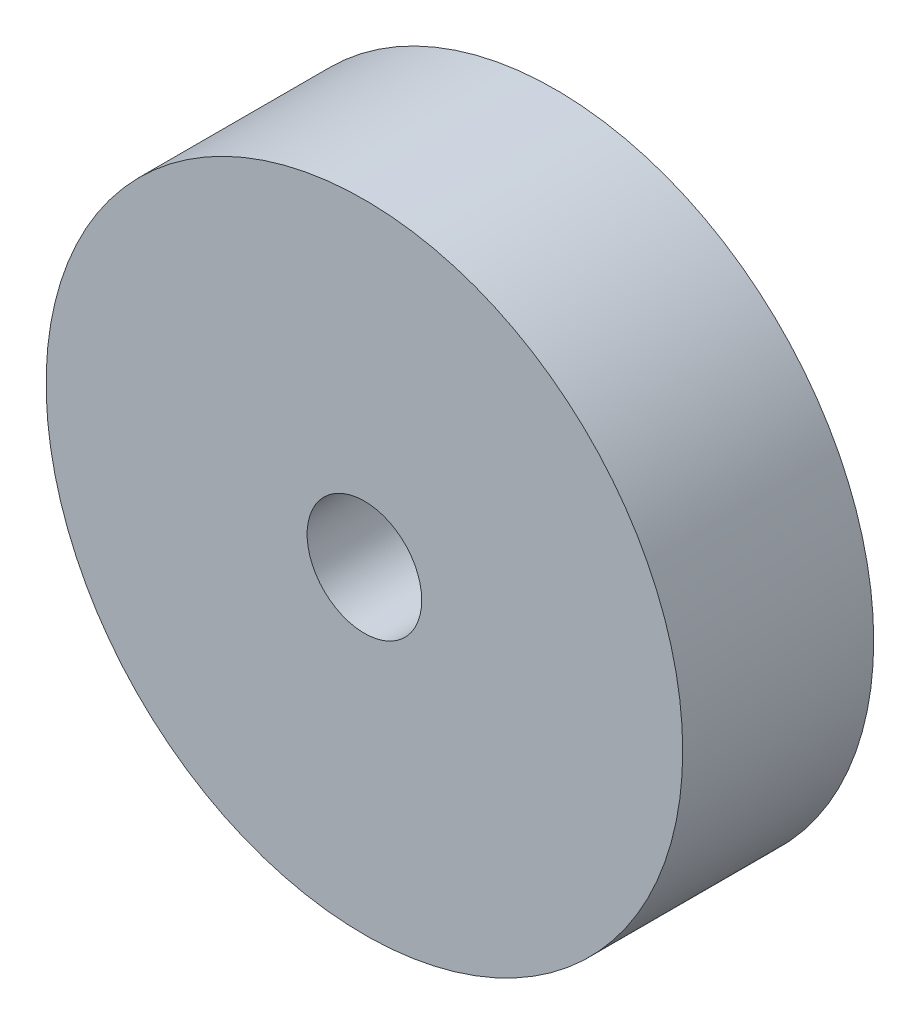
ISO-10303-21;
HEADER;
FILE_DESCRIPTION(('STEP AP214'),'2;1');
FILE_NAME('part.step','',(''),(''),'','','');
FILE_SCHEMA(('AUTOMOTIVE_DESIGN { 1 0 10303 214 1 1 1 1 }'));
ENDSEC;
DATA;
#1=APPLICATION_CONTEXT('core data for automotive mechanical design processes');
#2=APPLICATION_PROTOCOL_DEFINITION('international standard','automotive_design',2000,#1);
#3=PRODUCT_CONTEXT('',#1,'mechanical');
#4=PRODUCT('Part','Part','',(#3));
#5=PRODUCT_RELATED_PRODUCT_CATEGORY('part','',(#4));
#6=PRODUCT_DEFINITION_FORMATION('','',#4);
#7=PRODUCT_DEFINITION_CONTEXT('part definition',#1,'design');
#8=PRODUCT_DEFINITION('design','',#6,#7);
#9=PRODUCT_DEFINITION_SHAPE('','',#8);
#10=(LENGTH_UNIT() NAMED_UNIT(*) SI_UNIT(.MILLI.,.METRE.));
#11=(NAMED_UNIT(*) PLANE_ANGLE_UNIT() SI_UNIT($,.RADIAN.));
#12=(NAMED_UNIT(*) SI_UNIT($,.STERADIAN.) SOLID_ANGLE_UNIT());
#13=UNCERTAINTY_MEASURE_WITH_UNIT(LENGTH_MEASURE(1.E-05),#10,'distance_accuracy_value','');
#14=(GEOMETRIC_REPRESENTATION_CONTEXT(3) GLOBAL_UNCERTAINTY_ASSIGNED_CONTEXT((#13)) GLOBAL_UNIT_ASSIGNED_CONTEXT((#10,
#11,#12)) REPRESENTATION_CONTEXT('',''));
#15=CARTESIAN_POINT('',(0.,0.,0.));
#16=DIRECTION('',(0.,0.,1.));
#17=DIRECTION('',(1.,0.,0.));
#18=AXIS2_PLACEMENT_3D('',#15,#16,#17);
#19=CARTESIAN_POINT('',(0.,0.,3.));
#20=DIRECTION('',(0.,0.,1.));
#21=DIRECTION('',(1.,0.,0.));
#22=AXIS2_PLACEMENT_3D('',#19,#20,#21);
#23=PLANE('',#22);
#24=CARTESIAN_POINT('',(0.,0.,3.));
#25=DIRECTION('',(0.,0.,1.));
#26=DIRECTION('',(1.,0.,0.));
#27=AXIS2_PLACEMENT_3D('',#24,#25,#26);
#28=CIRCLE('',#27,5.);
#29=CARTESIAN_POINT('',(5.,0.,3.));
#30=VERTEX_POINT('',#29);
#31=EDGE_CURVE('E10',#30,#30,#28,.T.);
#32=ORIENTED_EDGE('',*,*,#31,.T.);
#33=EDGE_LOOP('',(#32));
#34=FACE_BOUND('',#33,.T.);
#35=CARTESIAN_POINT('',(0.,0.,3.));
#36=DIRECTION('',(0.,0.,1.));
#37=DIRECTION('',(1.,0.,0.));
#38=AXIS2_PLACEMENT_3D('',#35,#36,#37);
#39=CIRCLE('',#38,0.9);
#40=CARTESIAN_POINT('',(0.9,0.,3.));
#41=VERTEX_POINT('',#40);
#42=EDGE_CURVE('E54',#41,#41,#39,.T.);
#43=ORIENTED_EDGE('',*,*,#42,.F.);
#44=EDGE_LOOP('',(#43));
#45=FACE_BOUND('',#44,.T.);
#46=ADVANCED_FACE('F41',(#34,#45),#23,.T.);
#47=CARTESIAN_POINT('',(0.,0.,0.));
#48=DIRECTION('',(0.,0.,1.));
#49=DIRECTION('',(1.,0.,0.));
#50=AXIS2_PLACEMENT_3D('',#47,#48,#49);
#51=PLANE('',#50);
#52=CARTESIAN_POINT('',(0.,0.,0.));
#53=DIRECTION('',(0.,0.,1.));
#54=DIRECTION('',(1.,0.,0.));
#55=AXIS2_PLACEMENT_3D('',#52,#53,#54);
#56=CIRCLE('',#55,5.);
#57=CARTESIAN_POINT('',(5.,0.,0.));
#58=VERTEX_POINT('',#57);
#59=EDGE_CURVE('E45',#58,#58,#56,.T.);
#60=ORIENTED_EDGE('',*,*,#59,.F.);
#61=EDGE_LOOP('',(#60));
#62=FACE_BOUND('',#61,.T.);
#63=CARTESIAN_POINT('',(0.,0.,0.));
#64=DIRECTION('',(0.,0.,1.));
#65=DIRECTION('',(1.,0.,0.));
#66=AXIS2_PLACEMENT_3D('',#63,#64,#65);
#67=CIRCLE('',#66,0.9);
#68=CARTESIAN_POINT('',(0.9,0.,0.));
#69=VERTEX_POINT('',#68);
#70=EDGE_CURVE('E56',#69,#69,#67,.T.);
#71=ORIENTED_EDGE('',*,*,#70,.T.);
#72=EDGE_LOOP('',(#71));
#73=FACE_BOUND('',#72,.T.);
#74=ADVANCED_FACE('F68',(#62,#73),#51,.F.);
#75=CARTESIAN_POINT('',(0.,0.,3.));
#76=DIRECTION('',(0.,0.,-1.));
#77=DIRECTION('',(-1.,0.,0.));
#78=AXIS2_PLACEMENT_3D('',#75,#76,#77);
#79=CYLINDRICAL_SURFACE('',#78,5.);
#80=ORIENTED_EDGE('',*,*,#31,.F.);
#81=EDGE_LOOP('',(#80));
#82=FACE_BOUND('',#81,.T.);
#83=ORIENTED_EDGE('',*,*,#59,.T.);
#84=EDGE_LOOP('',(#83));
#85=FACE_BOUND('',#84,.T.);
#86=ADVANCED_FACE('F43',(#82,#85),#79,.T.);
#87=CARTESIAN_POINT('',(0.,0.,3.));
#88=DIRECTION('',(0.,0.,-1.));
#89=DIRECTION('',(-1.,0.,0.));
#90=AXIS2_PLACEMENT_3D('',#87,#88,#89);
#91=CYLINDRICAL_SURFACE('',#90,0.9);
#92=ORIENTED_EDGE('',*,*,#42,.T.);
#93=EDGE_LOOP('',(#92));
#94=FACE_BOUND('',#93,.T.);
#95=ORIENTED_EDGE('',*,*,#70,.F.);
#96=EDGE_LOOP('',(#95));
#97=FACE_BOUND('',#96,.T.);
#98=ADVANCED_FACE('F64',(#94,#97),#91,.F.);
#99=CLOSED_SHELL('',(#46,#74,#86,#98));
#100=MANIFOLD_SOLID_BREP('B2',#99);
#101=ADVANCED_BREP_SHAPE_REPRESENTATION('',(#18,#100),#14);
#102=SHAPE_DEFINITION_REPRESENTATION(#9,#101);
ENDSEC;
END-ISO-10303-21;
